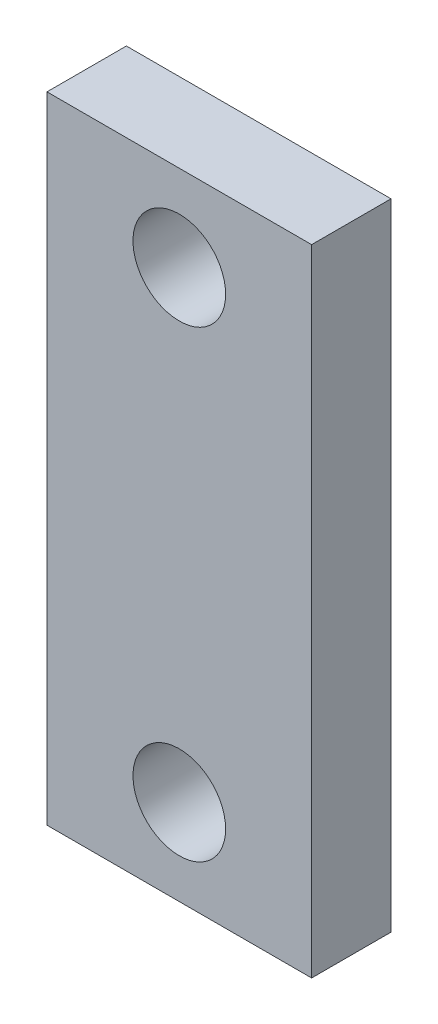
ISO-10303-21;
HEADER;
FILE_DESCRIPTION(('STEP AP214'),'2;1');
FILE_NAME('part.step','',(''),(''),'','','');
FILE_SCHEMA(('AUTOMOTIVE_DESIGN { 1 0 10303 214 1 1 1 1 }'));
ENDSEC;
DATA;
#1=APPLICATION_CONTEXT('core data for automotive mechanical design processes');
#2=APPLICATION_PROTOCOL_DEFINITION('international standard','automotive_design',2000,#1);
#3=PRODUCT_CONTEXT('',#1,'mechanical');
#4=PRODUCT('Part','Part','',(#3));
#5=PRODUCT_RELATED_PRODUCT_CATEGORY('part','',(#4));
#6=PRODUCT_DEFINITION_FORMATION('','',#4);
#7=PRODUCT_DEFINITION_CONTEXT('part definition',#1,'design');
#8=PRODUCT_DEFINITION('design','',#6,#7);
#9=PRODUCT_DEFINITION_SHAPE('','',#8);
#10=(LENGTH_UNIT() NAMED_UNIT(*) SI_UNIT(.MILLI.,.METRE.));
#11=(NAMED_UNIT(*) PLANE_ANGLE_UNIT() SI_UNIT($,.RADIAN.));
#12=(NAMED_UNIT(*) SI_UNIT($,.STERADIAN.) SOLID_ANGLE_UNIT());
#13=UNCERTAINTY_MEASURE_WITH_UNIT(LENGTH_MEASURE(1.E-05),#10,'distance_accuracy_value','');
#14=(GEOMETRIC_REPRESENTATION_CONTEXT(3) GLOBAL_UNCERTAINTY_ASSIGNED_CONTEXT((#13)) GLOBAL_UNIT_ASSIGNED_CONTEXT((#10,
#11,#12)) REPRESENTATION_CONTEXT('',''));
#15=CARTESIAN_POINT('',(0.,0.,0.));
#16=DIRECTION('',(0.,0.,1.));
#17=DIRECTION('',(1.,0.,0.));
#18=AXIS2_PLACEMENT_3D('',#15,#16,#17);
#19=CARTESIAN_POINT('',(0.,0.,3.));
#20=DIRECTION('',(0.,0.,-1.));
#21=DIRECTION('',(-1.,0.,0.));
#22=AXIS2_PLACEMENT_3D('',#19,#20,#21);
#23=PLANE('',#22);
#24=DIRECTION('',(0.,1.,0.));
#25=VECTOR('',#24,1.);
#26=CARTESIAN_POINT('',(5.,-12.,3.));
#27=LINE('',#26,#25);
#28=CARTESIAN_POINT('',(5.,-12.,3.));
#29=VERTEX_POINT('',#28);
#30=CARTESIAN_POINT('',(5.,12.,3.));
#31=VERTEX_POINT('',#30);
#32=EDGE_CURVE('E91',#29,#31,#27,.T.);
#33=ORIENTED_EDGE('',*,*,#32,.T.);
#34=DIRECTION('',(-1.,0.,0.));
#35=VECTOR('',#34,1.);
#36=CARTESIAN_POINT('',(-5.,12.,3.));
#37=LINE('',#36,#35);
#38=CARTESIAN_POINT('',(-5.,12.,3.));
#39=VERTEX_POINT('',#38);
#40=EDGE_CURVE('E86',#31,#39,#37,.T.);
#41=ORIENTED_EDGE('',*,*,#40,.T.);
#42=DIRECTION('',(0.,-1.,0.));
#43=VECTOR('',#42,1.);
#44=CARTESIAN_POINT('',(-5.,-12.,3.));
#45=LINE('',#44,#43);
#46=CARTESIAN_POINT('',(-5.,-12.,3.));
#47=VERTEX_POINT('',#46);
#48=EDGE_CURVE('E89',#39,#47,#45,.T.);
#49=ORIENTED_EDGE('',*,*,#48,.T.);
#50=DIRECTION('',(1.,0.,0.));
#51=VECTOR('',#50,1.);
#52=CARTESIAN_POINT('',(-5.,-12.,3.));
#53=LINE('',#52,#51);
#54=EDGE_CURVE('E56',#47,#29,#53,.T.);
#55=ORIENTED_EDGE('',*,*,#54,.T.);
#56=EDGE_LOOP('',(#33,#41,#49,#55));
#57=FACE_BOUND('',#56,.T.);
#58=CARTESIAN_POINT('',(0.,8.75,3.));
#59=DIRECTION('',(0.,0.,1.));
#60=DIRECTION('',(1.,0.,0.));
#61=AXIS2_PLACEMENT_3D('',#58,#59,#60);
#62=CIRCLE('',#61,1.75);
#63=CARTESIAN_POINT('',(1.75,8.75,3.));
#64=VERTEX_POINT('',#63);
#65=EDGE_CURVE('E106',#64,#64,#62,.T.);
#66=ORIENTED_EDGE('',*,*,#65,.F.);
#67=EDGE_LOOP('',(#66));
#68=FACE_BOUND('',#67,.T.);
#69=CARTESIAN_POINT('',(0.,-8.75,3.));
#70=DIRECTION('',(0.,0.,1.));
#71=DIRECTION('',(1.,0.,0.));
#72=AXIS2_PLACEMENT_3D('',#69,#70,#71);
#73=CIRCLE('',#72,1.75);
#74=CARTESIAN_POINT('',(1.75,-8.75,3.));
#75=VERTEX_POINT('',#74);
#76=EDGE_CURVE('E121',#75,#75,#73,.T.);
#77=ORIENTED_EDGE('',*,*,#76,.F.);
#78=EDGE_LOOP('',(#77));
#79=FACE_BOUND('',#78,.T.);
#80=ADVANCED_FACE('F39',(#57,#68,#79),#23,.F.);
#81=CARTESIAN_POINT('',(0.,0.,0.));
#82=DIRECTION('',(0.,0.,-1.));
#83=DIRECTION('',(-1.,0.,0.));
#84=AXIS2_PLACEMENT_3D('',#81,#82,#83);
#85=PLANE('',#84);
#86=CARTESIAN_POINT('',(0.,8.75,0.));
#87=DIRECTION('',(0.,0.,1.));
#88=DIRECTION('',(1.,0.,0.));
#89=AXIS2_PLACEMENT_3D('',#86,#87,#88);
#90=CIRCLE('',#89,1.75);
#91=CARTESIAN_POINT('',(1.75,8.75,0.));
#92=VERTEX_POINT('',#91);
#93=EDGE_CURVE('E118',#92,#92,#90,.T.);
#94=ORIENTED_EDGE('',*,*,#93,.T.);
#95=EDGE_LOOP('',(#94));
#96=FACE_BOUND('',#95,.T.);
#97=DIRECTION('',(0.,1.,0.));
#98=VECTOR('',#97,1.);
#99=CARTESIAN_POINT('',(5.,-12.,0.));
#100=LINE('',#99,#98);
#101=CARTESIAN_POINT('',(5.,-12.,0.));
#102=VERTEX_POINT('',#101);
#103=CARTESIAN_POINT('',(5.,12.,0.));
#104=VERTEX_POINT('',#103);
#105=EDGE_CURVE('E103',#102,#104,#100,.T.);
#106=ORIENTED_EDGE('',*,*,#105,.F.);
#107=DIRECTION('',(1.,0.,0.));
#108=VECTOR('',#107,1.);
#109=CARTESIAN_POINT('',(-5.,-12.,0.));
#110=LINE('',#109,#108);
#111=CARTESIAN_POINT('',(-5.,-12.,0.));
#112=VERTEX_POINT('',#111);
#113=EDGE_CURVE('E79',#112,#102,#110,.T.);
#114=ORIENTED_EDGE('',*,*,#113,.F.);
#115=DIRECTION('',(0.,-1.,0.));
#116=VECTOR('',#115,1.);
#117=CARTESIAN_POINT('',(-5.,-12.,0.));
#118=LINE('',#117,#116);
#119=CARTESIAN_POINT('',(-5.,12.,0.));
#120=VERTEX_POINT('',#119);
#121=EDGE_CURVE('E73',#120,#112,#118,.T.);
#122=ORIENTED_EDGE('',*,*,#121,.F.);
#123=DIRECTION('',(-1.,0.,0.));
#124=VECTOR('',#123,1.);
#125=CARTESIAN_POINT('',(-5.,12.,0.));
#126=LINE('',#125,#124);
#127=EDGE_CURVE('E95',#104,#120,#126,.T.);
#128=ORIENTED_EDGE('',*,*,#127,.F.);
#129=EDGE_LOOP('',(#106,#114,#122,#128));
#130=FACE_BOUND('',#129,.T.);
#131=CARTESIAN_POINT('',(0.,-8.75,0.));
#132=DIRECTION('',(0.,0.,1.));
#133=DIRECTION('',(1.,0.,0.));
#134=AXIS2_PLACEMENT_3D('',#131,#132,#133);
#135=CIRCLE('',#134,1.75);
#136=CARTESIAN_POINT('',(1.75,-8.75,0.));
#137=VERTEX_POINT('',#136);
#138=EDGE_CURVE('E124',#137,#137,#135,.T.);
#139=ORIENTED_EDGE('',*,*,#138,.T.);
#140=EDGE_LOOP('',(#139));
#141=FACE_BOUND('',#140,.T.);
#142=ADVANCED_FACE('F114',(#96,#130,#141),#85,.T.);
#143=CARTESIAN_POINT('',(5.,-12.,3.));
#144=DIRECTION('',(-1.,0.,0.));
#145=DIRECTION('',(0.,0.,1.));
#146=AXIS2_PLACEMENT_3D('',#143,#144,#145);
#147=PLANE('',#146);
#148=ORIENTED_EDGE('',*,*,#105,.T.);
#149=DIRECTION('',(0.,0.,-1.));
#150=VECTOR('',#149,1.);
#151=CARTESIAN_POINT('',(5.,12.,3.));
#152=LINE('',#151,#150);
#153=EDGE_CURVE('E11',#31,#104,#152,.T.);
#154=ORIENTED_EDGE('',*,*,#153,.F.);
#155=ORIENTED_EDGE('',*,*,#32,.F.);
#156=DIRECTION('',(0.,0.,-1.));
#157=VECTOR('',#156,1.);
#158=CARTESIAN_POINT('',(5.,-12.,3.));
#159=LINE('',#158,#157);
#160=EDGE_CURVE('E99',#29,#102,#159,.T.);
#161=ORIENTED_EDGE('',*,*,#160,.T.);
#162=EDGE_LOOP('',(#148,#154,#155,#161));
#163=FACE_BOUND('',#162,.T.);
#164=ADVANCED_FACE('F41',(#163),#147,.F.);
#165=CARTESIAN_POINT('',(-5.,12.,3.));
#166=DIRECTION('',(0.,-1.,0.));
#167=DIRECTION('',(0.,0.,-1.));
#168=AXIS2_PLACEMENT_3D('',#165,#166,#167);
#169=PLANE('',#168);
#170=ORIENTED_EDGE('',*,*,#127,.T.);
#171=DIRECTION('',(0.,0.,-1.));
#172=VECTOR('',#171,1.);
#173=CARTESIAN_POINT('',(-5.,12.,3.));
#174=LINE('',#173,#172);
#175=EDGE_CURVE('E48',#39,#120,#174,.T.);
#176=ORIENTED_EDGE('',*,*,#175,.F.);
#177=ORIENTED_EDGE('',*,*,#40,.F.);
#178=ORIENTED_EDGE('',*,*,#153,.T.);
#179=EDGE_LOOP('',(#170,#176,#177,#178));
#180=FACE_BOUND('',#179,.T.);
#181=ADVANCED_FACE('F94',(#180),#169,.F.);
#182=CARTESIAN_POINT('',(-5.,-12.,3.));
#183=DIRECTION('',(1.,0.,0.));
#184=DIRECTION('',(0.,0.,-1.));
#185=AXIS2_PLACEMENT_3D('',#182,#183,#184);
#186=PLANE('',#185);
#187=ORIENTED_EDGE('',*,*,#121,.T.);
#188=DIRECTION('',(0.,0.,-1.));
#189=VECTOR('',#188,1.);
#190=CARTESIAN_POINT('',(-5.,-12.,3.));
#191=LINE('',#190,#189);
#192=EDGE_CURVE('E96',#47,#112,#191,.T.);
#193=ORIENTED_EDGE('',*,*,#192,.F.);
#194=ORIENTED_EDGE('',*,*,#48,.F.);
#195=ORIENTED_EDGE('',*,*,#175,.T.);
#196=EDGE_LOOP('',(#187,#193,#194,#195));
#197=FACE_BOUND('',#196,.T.);
#198=ADVANCED_FACE('F97',(#197),#186,.F.);
#199=CARTESIAN_POINT('',(-5.,-12.,3.));
#200=DIRECTION('',(0.,1.,0.));
#201=DIRECTION('',(0.,0.,1.));
#202=AXIS2_PLACEMENT_3D('',#199,#200,#201);
#203=PLANE('',#202);
#204=ORIENTED_EDGE('',*,*,#113,.T.);
#205=ORIENTED_EDGE('',*,*,#160,.F.);
#206=ORIENTED_EDGE('',*,*,#54,.F.);
#207=ORIENTED_EDGE('',*,*,#192,.T.);
#208=EDGE_LOOP('',(#204,#205,#206,#207));
#209=FACE_BOUND('',#208,.T.);
#210=ADVANCED_FACE('F111',(#209),#203,.F.);
#211=CARTESIAN_POINT('',(0.,8.75,3.));
#212=DIRECTION('',(0.,0.,-1.));
#213=DIRECTION('',(-1.,0.,0.));
#214=AXIS2_PLACEMENT_3D('',#211,#212,#213);
#215=CYLINDRICAL_SURFACE('',#214,1.75);
#216=ORIENTED_EDGE('',*,*,#65,.T.);
#217=EDGE_LOOP('',(#216));
#218=FACE_BOUND('',#217,.T.);
#219=ORIENTED_EDGE('',*,*,#93,.F.);
#220=EDGE_LOOP('',(#219));
#221=FACE_BOUND('',#220,.T.);
#222=ADVANCED_FACE('F141',(#218,#221),#215,.F.);
#223=CARTESIAN_POINT('',(0.,-8.75,3.));
#224=DIRECTION('',(0.,0.,-1.));
#225=DIRECTION('',(-1.,0.,0.));
#226=AXIS2_PLACEMENT_3D('',#223,#224,#225);
#227=CYLINDRICAL_SURFACE('',#226,1.75);
#228=ORIENTED_EDGE('',*,*,#76,.T.);
#229=EDGE_LOOP('',(#228));
#230=FACE_BOUND('',#229,.T.);
#231=ORIENTED_EDGE('',*,*,#138,.F.);
#232=EDGE_LOOP('',(#231));
#233=FACE_BOUND('',#232,.T.);
#234=ADVANCED_FACE('F130',(#230,#233),#227,.F.);
#235=CLOSED_SHELL('',(#80,#142,#164,#181,#198,#210,#222,#234));
#236=MANIFOLD_SOLID_BREP('B2',#235);
#237=ADVANCED_BREP_SHAPE_REPRESENTATION('',(#18,#236),#14);
#238=SHAPE_DEFINITION_REPRESENTATION(#9,#237);
ENDSEC;
END-ISO-10303-21;
